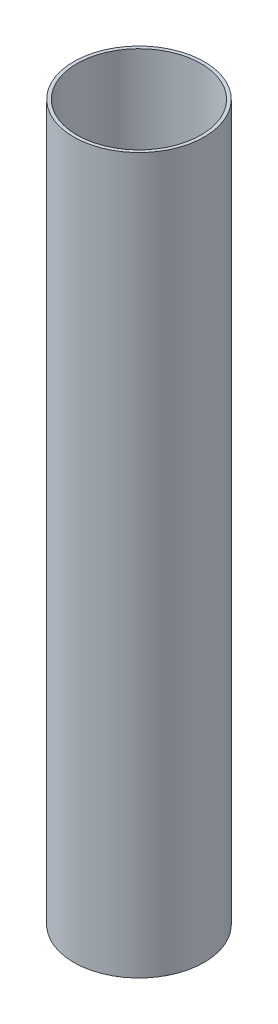
ISO-10303-21;
HEADER;
FILE_DESCRIPTION(('STEP AP214'),'2;1');
FILE_NAME('part.step','',(''),(''),'','','');
FILE_SCHEMA(('AUTOMOTIVE_DESIGN { 1 0 10303 214 1 1 1 1 }'));
ENDSEC;
DATA;
#1=APPLICATION_CONTEXT('core data for automotive mechanical design processes');
#2=APPLICATION_PROTOCOL_DEFINITION('international standard','automotive_design',2000,#1);
#3=PRODUCT_CONTEXT('',#1,'mechanical');
#4=PRODUCT('Part','Part','',(#3));
#5=PRODUCT_RELATED_PRODUCT_CATEGORY('part','',(#4));
#6=PRODUCT_DEFINITION_FORMATION('','',#4);
#7=PRODUCT_DEFINITION_CONTEXT('part definition',#1,'design');
#8=PRODUCT_DEFINITION('design','',#6,#7);
#9=PRODUCT_DEFINITION_SHAPE('','',#8);
#10=(LENGTH_UNIT() NAMED_UNIT(*) SI_UNIT(.MILLI.,.METRE.));
#11=(NAMED_UNIT(*) PLANE_ANGLE_UNIT() SI_UNIT($,.RADIAN.));
#12=(NAMED_UNIT(*) SI_UNIT($,.STERADIAN.) SOLID_ANGLE_UNIT());
#13=UNCERTAINTY_MEASURE_WITH_UNIT(LENGTH_MEASURE(1.E-05),#10,'distance_accuracy_value','');
#14=(GEOMETRIC_REPRESENTATION_CONTEXT(3) GLOBAL_UNCERTAINTY_ASSIGNED_CONTEXT((#13)) GLOBAL_UNIT_ASSIGNED_CONTEXT((#10,
#11,#12)) REPRESENTATION_CONTEXT('',''));
#15=CARTESIAN_POINT('',(0.,0.,0.));
#16=DIRECTION('',(0.,0.,1.));
#17=DIRECTION('',(1.,0.,0.));
#18=AXIS2_PLACEMENT_3D('',#15,#16,#17);
#19=CARTESIAN_POINT('',(0.,382.1938,0.));
#20=DIRECTION('',(0.,1.,0.));
#21=DIRECTION('',(0.,0.,1.));
#22=AXIS2_PLACEMENT_3D('',#19,#20,#21);
#23=PLANE('',#22);
#24=CARTESIAN_POINT('',(0.,382.1938,0.));
#25=DIRECTION('',(0.,1.,0.));
#26=DIRECTION('',(0.,0.,1.));
#27=AXIS2_PLACEMENT_3D('',#24,#25,#26);
#28=CIRCLE('',#27,34.8996);
#29=CARTESIAN_POINT('',(0.,382.1938,34.8996));
#30=VERTEX_POINT('',#29);
#31=EDGE_CURVE('E10',#30,#30,#28,.T.);
#32=ORIENTED_EDGE('',*,*,#31,.T.);
#33=EDGE_LOOP('',(#32));
#34=FACE_BOUND('',#33,.T.);
#35=CARTESIAN_POINT('',(0.,382.1938,0.));
#36=DIRECTION('',(0.,1.,0.));
#37=DIRECTION('',(0.,0.,1.));
#38=AXIS2_PLACEMENT_3D('',#35,#36,#37);
#39=CIRCLE('',#38,33.147);
#40=CARTESIAN_POINT('',(0.,382.1938,33.147));
#41=VERTEX_POINT('',#40);
#42=EDGE_CURVE('E52',#41,#41,#39,.T.);
#43=ORIENTED_EDGE('',*,*,#42,.F.);
#44=EDGE_LOOP('',(#43));
#45=FACE_BOUND('',#44,.T.);
#46=ADVANCED_FACE('F41',(#34,#45),#23,.T.);
#47=CARTESIAN_POINT('',(0.,0.,0.));
#48=DIRECTION('',(0.,1.,0.));
#49=DIRECTION('',(0.,0.,1.));
#50=AXIS2_PLACEMENT_3D('',#47,#48,#49);
#51=PLANE('',#50);
#52=CARTESIAN_POINT('',(0.,0.,0.));
#53=DIRECTION('',(0.,1.,0.));
#54=DIRECTION('',(0.,0.,1.));
#55=AXIS2_PLACEMENT_3D('',#52,#53,#54);
#56=CIRCLE('',#55,34.8996);
#57=CARTESIAN_POINT('',(0.,0.,34.8996));
#58=VERTEX_POINT('',#57);
#59=EDGE_CURVE('E45',#58,#58,#56,.T.);
#60=ORIENTED_EDGE('',*,*,#59,.F.);
#61=EDGE_LOOP('',(#60));
#62=FACE_BOUND('',#61,.T.);
#63=CARTESIAN_POINT('',(0.,0.,0.));
#64=DIRECTION('',(0.,1.,0.));
#65=DIRECTION('',(0.,0.,1.));
#66=AXIS2_PLACEMENT_3D('',#63,#64,#65);
#67=CIRCLE('',#66,33.147);
#68=CARTESIAN_POINT('',(0.,0.,33.147));
#69=VERTEX_POINT('',#68);
#70=EDGE_CURVE('E54',#69,#69,#67,.T.);
#71=ORIENTED_EDGE('',*,*,#70,.T.);
#72=EDGE_LOOP('',(#71));
#73=FACE_BOUND('',#72,.T.);
#74=ADVANCED_FACE('F64',(#62,#73),#51,.F.);
#75=CARTESIAN_POINT('',(0.,382.1938,0.));
#76=DIRECTION('',(0.,-1.,0.));
#77=DIRECTION('',(0.,0.,-1.));
#78=AXIS2_PLACEMENT_3D('',#75,#76,#77);
#79=CYLINDRICAL_SURFACE('',#78,34.8996);
#80=ORIENTED_EDGE('',*,*,#31,.F.);
#81=EDGE_LOOP('',(#80));
#82=FACE_BOUND('',#81,.T.);
#83=ORIENTED_EDGE('',*,*,#59,.T.);
#84=EDGE_LOOP('',(#83));
#85=FACE_BOUND('',#84,.T.);
#86=ADVANCED_FACE('F43',(#82,#85),#79,.T.);
#87=CARTESIAN_POINT('',(0.,382.1938,0.));
#88=DIRECTION('',(0.,-1.,0.));
#89=DIRECTION('',(0.,0.,-1.));
#90=AXIS2_PLACEMENT_3D('',#87,#88,#89);
#91=CYLINDRICAL_SURFACE('',#90,33.147);
#92=ORIENTED_EDGE('',*,*,#42,.T.);
#93=EDGE_LOOP('',(#92));
#94=FACE_BOUND('',#93,.T.);
#95=ORIENTED_EDGE('',*,*,#70,.F.);
#96=EDGE_LOOP('',(#95));
#97=FACE_BOUND('',#96,.T.);
#98=ADVANCED_FACE('F60',(#94,#97),#91,.F.);
#99=CLOSED_SHELL('',(#46,#74,#86,#98));
#100=MANIFOLD_SOLID_BREP('B2',#99);
#101=ADVANCED_BREP_SHAPE_REPRESENTATION('',(#18,#100),#14);
#102=SHAPE_DEFINITION_REPRESENTATION(#9,#101);
ENDSEC;
END-ISO-10303-21;
